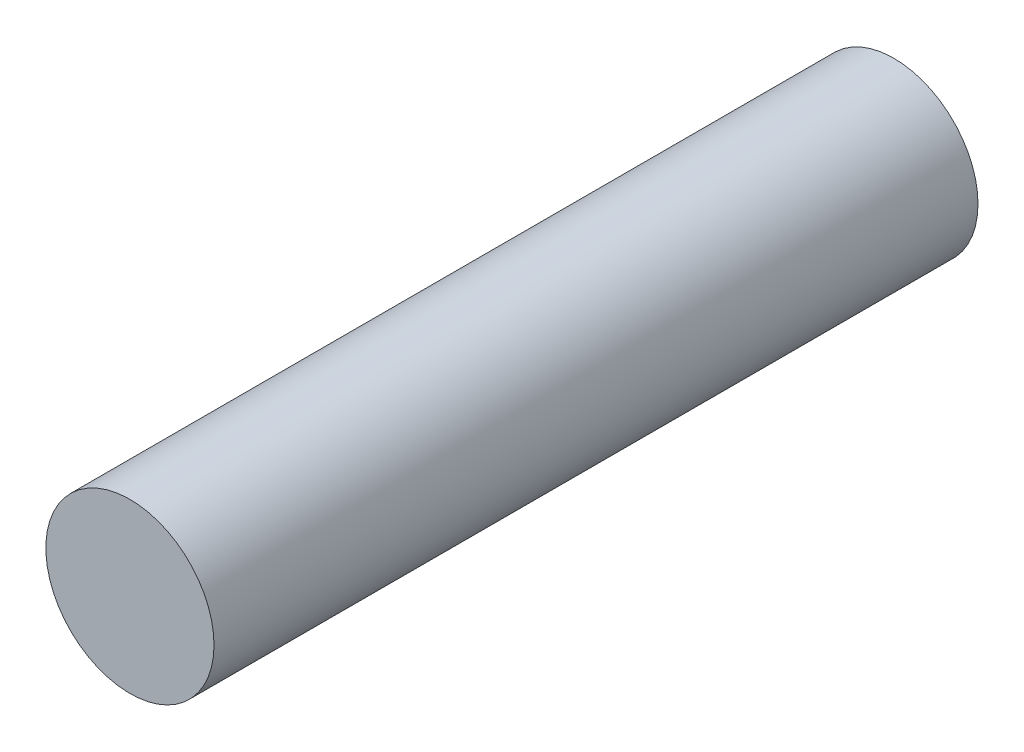
ISO-10303-21;
HEADER;
FILE_DESCRIPTION(('STEP AP214'),'2;1');
FILE_NAME('part.step','',(''),(''),'','','');
FILE_SCHEMA(('AUTOMOTIVE_DESIGN { 1 0 10303 214 1 1 1 1 }'));
ENDSEC;
DATA;
#1=APPLICATION_CONTEXT('core data for automotive mechanical design processes');
#2=APPLICATION_PROTOCOL_DEFINITION('international standard','automotive_design',2000,#1);
#3=PRODUCT_CONTEXT('',#1,'mechanical');
#4=PRODUCT('Part','Part','',(#3));
#5=PRODUCT_RELATED_PRODUCT_CATEGORY('part','',(#4));
#6=PRODUCT_DEFINITION_FORMATION('','',#4);
#7=PRODUCT_DEFINITION_CONTEXT('part definition',#1,'design');
#8=PRODUCT_DEFINITION('design','',#6,#7);
#9=PRODUCT_DEFINITION_SHAPE('','',#8);
#10=(LENGTH_UNIT() NAMED_UNIT(*) SI_UNIT(.MILLI.,.METRE.));
#11=(NAMED_UNIT(*) PLANE_ANGLE_UNIT() SI_UNIT($,.RADIAN.));
#12=(NAMED_UNIT(*) SI_UNIT($,.STERADIAN.) SOLID_ANGLE_UNIT());
#13=UNCERTAINTY_MEASURE_WITH_UNIT(LENGTH_MEASURE(1.E-05),#10,'distance_accuracy_value','');
#14=(GEOMETRIC_REPRESENTATION_CONTEXT(3) GLOBAL_UNCERTAINTY_ASSIGNED_CONTEXT((#13)) GLOBAL_UNIT_ASSIGNED_CONTEXT((#10,
#11,#12)) REPRESENTATION_CONTEXT('',''));
#15=CARTESIAN_POINT('',(0.,0.,0.));
#16=DIRECTION('',(0.,0.,1.));
#17=DIRECTION('',(1.,0.,0.));
#18=AXIS2_PLACEMENT_3D('',#15,#16,#17);
#19=CARTESIAN_POINT('',(0.,0.,150.));
#20=DIRECTION('',(0.,0.,-1.));
#21=DIRECTION('',(-1.,0.,0.));
#22=AXIS2_PLACEMENT_3D('',#19,#20,#21);
#23=CYLINDRICAL_SURFACE('',#22,16.51);
#24=CARTESIAN_POINT('',(0.,0.,150.));
#25=DIRECTION('',(0.,0.,1.));
#26=DIRECTION('',(1.,0.,0.));
#27=AXIS2_PLACEMENT_3D('',#24,#25,#26);
#28=CIRCLE('',#27,16.51);
#29=CARTESIAN_POINT('',(16.51,0.,150.));
#30=VERTEX_POINT('',#29);
#31=EDGE_CURVE('E10',#30,#30,#28,.T.);
#32=ORIENTED_EDGE('',*,*,#31,.F.);
#33=EDGE_LOOP('',(#32));
#34=FACE_BOUND('',#33,.T.);
#35=CARTESIAN_POINT('',(0.,0.,0.));
#36=DIRECTION('',(0.,0.,1.));
#37=DIRECTION('',(1.,0.,0.));
#38=AXIS2_PLACEMENT_3D('',#35,#36,#37);
#39=CIRCLE('',#38,16.51);
#40=CARTESIAN_POINT('',(16.51,0.,0.));
#41=VERTEX_POINT('',#40);
#42=EDGE_CURVE('E38',#41,#41,#39,.T.);
#43=ORIENTED_EDGE('',*,*,#42,.T.);
#44=EDGE_LOOP('',(#43));
#45=FACE_BOUND('',#44,.T.);
#46=ADVANCED_FACE('F35',(#34,#45),#23,.T.);
#47=CARTESIAN_POINT('',(0.,0.,150.));
#48=DIRECTION('',(0.,0.,1.));
#49=DIRECTION('',(1.,0.,0.));
#50=AXIS2_PLACEMENT_3D('',#47,#48,#49);
#51=PLANE('',#50);
#52=ORIENTED_EDGE('',*,*,#31,.T.);
#53=EDGE_LOOP('',(#52));
#54=FACE_BOUND('',#53,.T.);
#55=ADVANCED_FACE('F50',(#54),#51,.T.);
#56=CARTESIAN_POINT('',(0.,0.,0.));
#57=DIRECTION('',(0.,0.,1.));
#58=DIRECTION('',(1.,0.,0.));
#59=AXIS2_PLACEMENT_3D('',#56,#57,#58);
#60=PLANE('',#59);
#61=ORIENTED_EDGE('',*,*,#42,.F.);
#62=EDGE_LOOP('',(#61));
#63=FACE_BOUND('',#62,.T.);
#64=ADVANCED_FACE('F48',(#63),#60,.F.);
#65=CLOSED_SHELL('',(#46,#55,#64));
#66=MANIFOLD_SOLID_BREP('B2',#65);
#67=ADVANCED_BREP_SHAPE_REPRESENTATION('',(#18,#66),#14);
#68=SHAPE_DEFINITION_REPRESENTATION(#9,#67);
ENDSEC;
END-ISO-10303-21;
